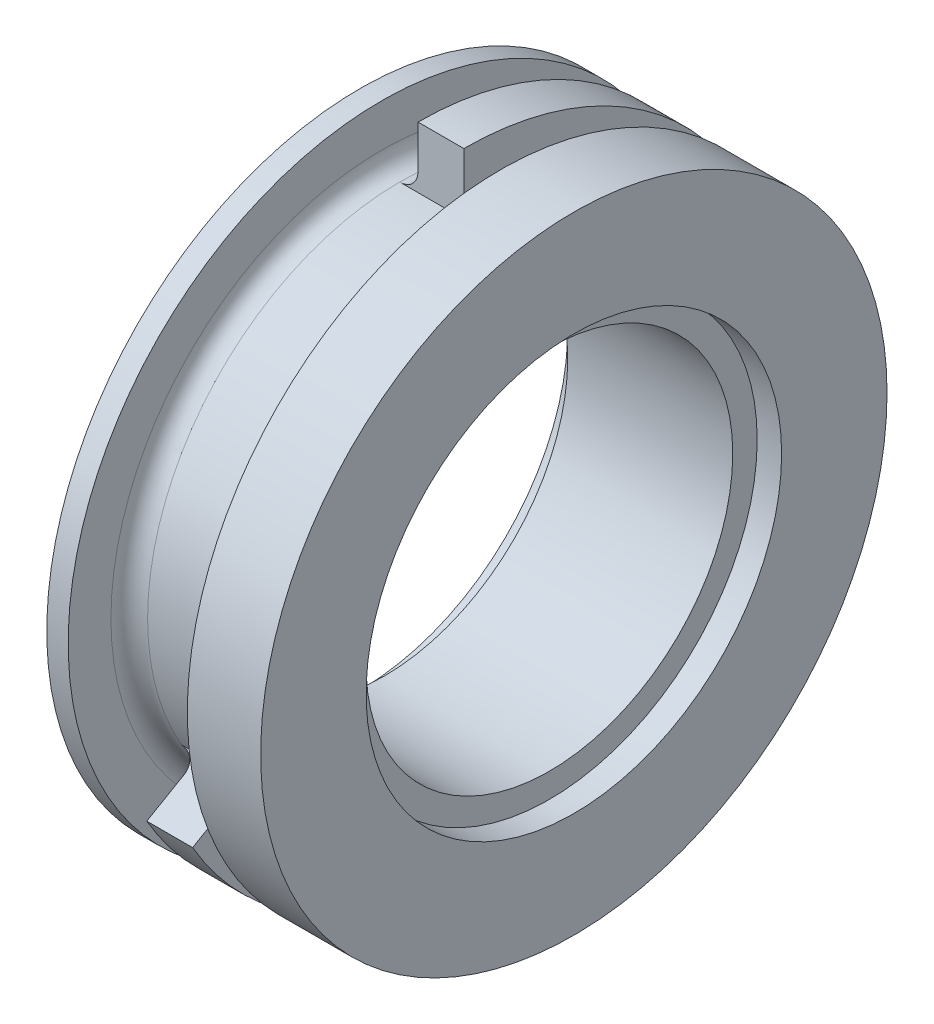
ISO-10303-21;
HEADER;
FILE_DESCRIPTION(('STEP AP214'),'2;1');
FILE_NAME('part.step','',(''),(''),'','','');
FILE_SCHEMA(('AUTOMOTIVE_DESIGN { 1 0 10303 214 1 1 1 1 }'));
ENDSEC;
DATA;
#1=APPLICATION_CONTEXT('core data for automotive mechanical design processes');
#2=APPLICATION_PROTOCOL_DEFINITION('international standard','automotive_design',2000,#1);
#3=PRODUCT_CONTEXT('',#1,'mechanical');
#4=PRODUCT('Part','Part','',(#3));
#5=PRODUCT_RELATED_PRODUCT_CATEGORY('part','',(#4));
#6=PRODUCT_DEFINITION_FORMATION('','',#4);
#7=PRODUCT_DEFINITION_CONTEXT('part definition',#1,'design');
#8=PRODUCT_DEFINITION('design','',#6,#7);
#9=PRODUCT_DEFINITION_SHAPE('','',#8);
#10=(LENGTH_UNIT() NAMED_UNIT(*) SI_UNIT(.MILLI.,.METRE.));
#11=(NAMED_UNIT(*) PLANE_ANGLE_UNIT() SI_UNIT($,.RADIAN.));
#12=(NAMED_UNIT(*) SI_UNIT($,.STERADIAN.) SOLID_ANGLE_UNIT());
#13=UNCERTAINTY_MEASURE_WITH_UNIT(LENGTH_MEASURE(1.E-05),#10,'distance_accuracy_value','');
#14=(GEOMETRIC_REPRESENTATION_CONTEXT(3) GLOBAL_UNCERTAINTY_ASSIGNED_CONTEXT((#13)) GLOBAL_UNIT_ASSIGNED_CONTEXT((#10,
#11,#12)) REPRESENTATION_CONTEXT('',''));
#15=CARTESIAN_POINT('',(0.,0.,0.));
#16=DIRECTION('',(0.,0.,1.));
#17=DIRECTION('',(1.,0.,0.));
#18=AXIS2_PLACEMENT_3D('',#15,#16,#17);
#19=CARTESIAN_POINT('',(7.,0.,0.));
#20=DIRECTION('',(1.,0.,0.));
#21=DIRECTION('',(0.,0.,-1.));
#22=AXIS2_PLACEMENT_3D('',#19,#20,#21);
#23=CYLINDRICAL_SURFACE('',#22,6.);
#24=CARTESIAN_POINT('',(6.2,0.,0.));
#25=DIRECTION('',(1.,0.,0.));
#26=DIRECTION('',(0.,0.,-1.));
#27=AXIS2_PLACEMENT_3D('',#24,#25,#26);
#28=CIRCLE('',#27,6.);
#29=CARTESIAN_POINT('',(6.2,0.,-6.));
#30=VERTEX_POINT('',#29);
#31=EDGE_CURVE('E158',#30,#30,#28,.T.);
#32=ORIENTED_EDGE('',*,*,#31,.T.);
#33=EDGE_LOOP('',(#32));
#34=FACE_BOUND('',#33,.T.);
#35=CARTESIAN_POINT('',(0.8,0.,0.));
#36=DIRECTION('',(-1.,0.,0.));
#37=DIRECTION('',(0.,0.,1.));
#38=AXIS2_PLACEMENT_3D('',#35,#36,#37);
#39=CIRCLE('',#38,6.);
#40=CARTESIAN_POINT('',(0.8,0.,6.));
#41=VERTEX_POINT('',#40);
#42=EDGE_CURVE('E47',#41,#41,#39,.T.);
#43=ORIENTED_EDGE('',*,*,#42,.T.);
#44=EDGE_LOOP('',(#43));
#45=FACE_BOUND('',#44,.T.);
#46=ADVANCED_FACE('F43',(#34,#45),#23,.F.);
#47=CARTESIAN_POINT('',(7.,0.,0.));
#48=DIRECTION('',(-1.,0.,0.));
#49=DIRECTION('',(0.,0.,1.));
#50=AXIS2_PLACEMENT_3D('',#47,#48,#49);
#51=PLANE('',#50);
#52=CARTESIAN_POINT('',(7.,0.,0.));
#53=DIRECTION('',(1.,0.,0.));
#54=DIRECTION('',(0.,0.,-1.));
#55=AXIS2_PLACEMENT_3D('',#52,#53,#54);
#56=CIRCLE('',#55,6.8);
#57=CARTESIAN_POINT('',(7.,0.,-6.8));
#58=VERTEX_POINT('',#57);
#59=EDGE_CURVE('E164',#58,#58,#56,.T.);
#60=ORIENTED_EDGE('',*,*,#59,.F.);
#61=EDGE_LOOP('',(#60));
#62=FACE_BOUND('',#61,.T.);
#63=CARTESIAN_POINT('',(7.,0.,0.));
#64=DIRECTION('',(1.,0.,0.));
#65=DIRECTION('',(0.,0.,-1.));
#66=AXIS2_PLACEMENT_3D('',#63,#64,#65);
#67=CIRCLE('',#66,10.25);
#68=CARTESIAN_POINT('',(7.,0.,-10.25));
#69=VERTEX_POINT('',#68);
#70=EDGE_CURVE('E126',#69,#69,#67,.T.);
#71=ORIENTED_EDGE('',*,*,#70,.T.);
#72=EDGE_LOOP('',(#71));
#73=FACE_BOUND('',#72,.T.);
#74=ADVANCED_FACE('F210',(#62,#73),#51,.F.);
#75=CARTESIAN_POINT('',(7.,0.,0.));
#76=DIRECTION('',(1.,0.,0.));
#77=DIRECTION('',(0.,0.,-1.));
#78=AXIS2_PLACEMENT_3D('',#75,#76,#77);
#79=CYLINDRICAL_SURFACE('',#78,10.25);
#80=ORIENTED_EDGE('',*,*,#70,.F.);
#81=EDGE_LOOP('',(#80));
#82=FACE_BOUND('',#81,.T.);
#83=CARTESIAN_POINT('',(4.6,0.,0.));
#84=DIRECTION('',(1.,0.,0.));
#85=DIRECTION('',(0.,0.,-1.));
#86=AXIS2_PLACEMENT_3D('',#83,#84,#85);
#87=CIRCLE('',#86,10.25);
#88=CARTESIAN_POINT('',(4.6,0.,-10.25));
#89=VERTEX_POINT('',#88);
#90=EDGE_CURVE('E123',#89,#89,#87,.T.);
#91=ORIENTED_EDGE('',*,*,#90,.T.);
#92=EDGE_LOOP('',(#91));
#93=FACE_BOUND('',#92,.T.);
#94=ADVANCED_FACE('F215',(#82,#93),#79,.T.);
#95=CARTESIAN_POINT('',(4.6,0.,0.));
#96=DIRECTION('',(1.,0.,0.));
#97=DIRECTION('',(0.,0.,-1.));
#98=AXIS2_PLACEMENT_3D('',#95,#96,#97);
#99=PLANE('',#98);
#100=CARTESIAN_POINT('',(4.6,0.,0.));
#101=DIRECTION('',(1.,0.,0.));
#102=DIRECTION('',(0.,0.,-1.));
#103=AXIS2_PLACEMENT_3D('',#100,#101,#102);
#104=CIRCLE('',#103,8.85);
#105=CARTESIAN_POINT('',(4.6,0.,-8.85));
#106=VERTEX_POINT('',#105);
#107=EDGE_CURVE('E134',#106,#106,#104,.T.);
#108=ORIENTED_EDGE('',*,*,#107,.T.);
#109=EDGE_LOOP('',(#108));
#110=FACE_BOUND('',#109,.T.);
#111=ORIENTED_EDGE('',*,*,#90,.F.);
#112=EDGE_LOOP('',(#111));
#113=FACE_BOUND('',#112,.T.);
#114=ADVANCED_FACE('F369',(#110,#113),#99,.F.);
#115=CARTESIAN_POINT('',(3.4,0.,0.));
#116=DIRECTION('',(-1.,0.,0.));
#117=DIRECTION('',(0.,0.,1.));
#118=AXIS2_PLACEMENT_3D('',#115,#116,#117);
#119=PLANE('',#118);
#120=DIRECTION('',(0.,1.,0.));
#121=VECTOR('',#120,1.);
#122=CARTESIAN_POINT('',(3.4,10.25,0.));
#123=LINE('',#122,#121);
#124=CARTESIAN_POINT('',(3.4,8.85,0.));
#125=VERTEX_POINT('',#124);
#126=CARTESIAN_POINT('',(3.4,10.25,0.));
#127=VERTEX_POINT('',#126);
#128=EDGE_CURVE('E96',#125,#127,#123,.T.);
#129=ORIENTED_EDGE('',*,*,#128,.F.);
#130=CARTESIAN_POINT('',(3.4,0.,0.));
#131=DIRECTION('',(-1.,0.,0.));
#132=DIRECTION('',(0.,0.,1.));
#133=AXIS2_PLACEMENT_3D('',#130,#131,#132);
#134=CIRCLE('',#133,8.85);
#135=CARTESIAN_POINT('',(3.4,-4.42500000000004,7.66432482349226));
#136=VERTEX_POINT('',#135);
#137=EDGE_CURVE('E143',#125,#136,#134,.T.);
#138=ORIENTED_EDGE('',*,*,#137,.T.);
#139=DIRECTION('',(0.,-0.500000000000004,0.866025403784436));
#140=VECTOR('',#139,1.);
#141=CARTESIAN_POINT('',(3.4,-5.12500000000004,8.87676038879047));
#142=LINE('',#141,#140);
#143=CARTESIAN_POINT('',(3.4,-5.12500000000004,8.87676038879047));
#144=VERTEX_POINT('',#143);
#145=EDGE_CURVE('E121',#136,#144,#142,.T.);
#146=ORIENTED_EDGE('',*,*,#145,.T.);
#147=CARTESIAN_POINT('',(3.4,0.,0.));
#148=DIRECTION('',(1.,0.,0.));
#149=DIRECTION('',(0.,0.,-1.));
#150=AXIS2_PLACEMENT_3D('',#147,#148,#149);
#151=CIRCLE('',#150,10.25);
#152=EDGE_CURVE('E114',#144,#127,#151,.T.);
#153=ORIENTED_EDGE('',*,*,#152,.T.);
#154=EDGE_LOOP('',(#129,#138,#146,#153));
#155=FACE_BOUND('',#154,.T.);
#156=ADVANCED_FACE('F119',(#155),#119,.F.);
#157=CARTESIAN_POINT('',(7.,0.,0.));
#158=DIRECTION('',(1.,0.,0.));
#159=DIRECTION('',(0.,0.,-1.));
#160=AXIS2_PLACEMENT_3D('',#157,#158,#159);
#161=CYLINDRICAL_SURFACE('',#160,10.25);
#162=ORIENTED_EDGE('',*,*,#152,.F.);
#163=DIRECTION('',(-1.,0.,0.));
#164=VECTOR('',#163,1.);
#165=CARTESIAN_POINT('',(1.9,-5.12500000000004,8.87676038879047));
#166=LINE('',#165,#164);
#167=CARTESIAN_POINT('',(1.9,-5.12500000000004,8.87676038879047));
#168=VERTEX_POINT('',#167);
#169=EDGE_CURVE('E178',#144,#168,#166,.T.);
#170=ORIENTED_EDGE('',*,*,#169,.T.);
#171=CARTESIAN_POINT('',(1.9,0.,0.));
#172=DIRECTION('',(1.,0.,0.));
#173=DIRECTION('',(0.,0.,-1.));
#174=AXIS2_PLACEMENT_3D('',#171,#172,#173);
#175=CIRCLE('',#174,10.25);
#176=CARTESIAN_POINT('',(1.9,10.25,0.));
#177=VERTEX_POINT('',#176);
#178=EDGE_CURVE('E116',#168,#177,#175,.T.);
#179=ORIENTED_EDGE('',*,*,#178,.T.);
#180=DIRECTION('',(-1.,0.,0.));
#181=VECTOR('',#180,1.);
#182=CARTESIAN_POINT('',(1.9,10.25,0.));
#183=LINE('',#182,#181);
#184=EDGE_CURVE('E100',#127,#177,#183,.T.);
#185=ORIENTED_EDGE('',*,*,#184,.F.);
#186=EDGE_LOOP('',(#162,#170,#179,#185));
#187=FACE_BOUND('',#186,.T.);
#188=ADVANCED_FACE('F112',(#187),#161,.T.);
#189=CARTESIAN_POINT('',(1.9,0.,0.));
#190=DIRECTION('',(1.,0.,0.));
#191=DIRECTION('',(0.,0.,-1.));
#192=AXIS2_PLACEMENT_3D('',#189,#190,#191);
#193=PLANE('',#192);
#194=DIRECTION('',(0.,0.500000000000004,-0.866025403784436));
#195=VECTOR('',#194,1.);
#196=CARTESIAN_POINT('',(1.9,-5.12500000000004,8.87676038879047));
#197=LINE('',#196,#195);
#198=CARTESIAN_POINT('',(1.9,-4.42500000000003,7.66432482349226));
#199=VERTEX_POINT('',#198);
#200=EDGE_CURVE('E180',#168,#199,#197,.T.);
#201=ORIENTED_EDGE('',*,*,#200,.T.);
#202=CARTESIAN_POINT('',(1.9,0.,0.));
#203=DIRECTION('',(1.,0.,0.));
#204=DIRECTION('',(0.,0.,-1.));
#205=AXIS2_PLACEMENT_3D('',#202,#203,#204);
#206=CIRCLE('',#205,8.85);
#207=CARTESIAN_POINT('',(1.9,8.85,0.));
#208=VERTEX_POINT('',#207);
#209=EDGE_CURVE('E145',#199,#208,#206,.T.);
#210=ORIENTED_EDGE('',*,*,#209,.T.);
#211=DIRECTION('',(0.,-1.,0.));
#212=VECTOR('',#211,1.);
#213=CARTESIAN_POINT('',(1.9,10.25,0.));
#214=LINE('',#213,#212);
#215=EDGE_CURVE('E117',#177,#208,#214,.T.);
#216=ORIENTED_EDGE('',*,*,#215,.F.);
#217=ORIENTED_EDGE('',*,*,#178,.F.);
#218=EDGE_LOOP('',(#201,#210,#216,#217));
#219=FACE_BOUND('',#218,.T.);
#220=ADVANCED_FACE('F326',(#219),#193,.F.);
#221=CARTESIAN_POINT('',(7.,0.,0.));
#222=DIRECTION('',(1.,0.,0.));
#223=DIRECTION('',(0.,0.,-1.));
#224=AXIS2_PLACEMENT_3D('',#221,#222,#223);
#225=CYLINDRICAL_SURFACE('',#224,8.25);
#226=CARTESIAN_POINT('',(4.,0.,0.));
#227=DIRECTION('',(1.,0.,0.));
#228=DIRECTION('',(0.,0.,-1.));
#229=AXIS2_PLACEMENT_3D('',#226,#227,#228);
#230=CIRCLE('',#229,8.25);
#231=CARTESIAN_POINT('',(4.,-4.12500000000003,7.1447095812216));
#232=VERTEX_POINT('',#231);
#233=CARTESIAN_POINT('',(4.,8.25,0.));
#234=VERTEX_POINT('',#233);
#235=EDGE_CURVE('E140',#232,#234,#230,.F.);
#236=ORIENTED_EDGE('',*,*,#235,.T.);
#237=DIRECTION('',(1.,0.,0.));
#238=VECTOR('',#237,1.);
#239=CARTESIAN_POINT('',(1.9,8.25,0.));
#240=LINE('',#239,#238);
#241=CARTESIAN_POINT('',(1.3,8.25,0.));
#242=VERTEX_POINT('',#241);
#243=EDGE_CURVE('E175',#242,#234,#240,.T.);
#244=ORIENTED_EDGE('',*,*,#243,.F.);
#245=CARTESIAN_POINT('',(1.3,0.,0.));
#246=DIRECTION('',(-1.,0.,0.));
#247=DIRECTION('',(0.,0.,1.));
#248=AXIS2_PLACEMENT_3D('',#245,#246,#247);
#249=CIRCLE('',#248,8.25);
#250=CARTESIAN_POINT('',(1.3,-4.12500000000003,7.1447095812216));
#251=VERTEX_POINT('',#250);
#252=EDGE_CURVE('E137',#242,#251,#249,.F.);
#253=ORIENTED_EDGE('',*,*,#252,.T.);
#254=DIRECTION('',(1.,0.,0.));
#255=VECTOR('',#254,1.);
#256=CARTESIAN_POINT('',(1.9,-4.12500000000003,7.1447095812216));
#257=LINE('',#256,#255);
#258=EDGE_CURVE('E182',#251,#232,#257,.T.);
#259=ORIENTED_EDGE('',*,*,#258,.T.);
#260=EDGE_LOOP('',(#236,#244,#253,#259));
#261=FACE_BOUND('',#260,.T.);
#262=ADVANCED_FACE('F321',(#261),#225,.T.);
#263=CARTESIAN_POINT('',(0.7,0.,0.));
#264=DIRECTION('',(-1.,0.,0.));
#265=DIRECTION('',(0.,0.,1.));
#266=AXIS2_PLACEMENT_3D('',#263,#264,#265);
#267=PLANE('',#266);
#268=CARTESIAN_POINT('',(0.7,0.,0.));
#269=DIRECTION('',(-1.,0.,0.));
#270=DIRECTION('',(0.,0.,1.));
#271=AXIS2_PLACEMENT_3D('',#268,#269,#270);
#272=CIRCLE('',#271,8.85);
#273=CARTESIAN_POINT('',(0.7,0.,8.85));
#274=VERTEX_POINT('',#273);
#275=EDGE_CURVE('E147',#274,#274,#272,.T.);
#276=ORIENTED_EDGE('',*,*,#275,.T.);
#277=EDGE_LOOP('',(#276));
#278=FACE_BOUND('',#277,.T.);
#279=CARTESIAN_POINT('',(0.7,0.,0.));
#280=DIRECTION('',(1.,0.,0.));
#281=DIRECTION('',(0.,0.,-1.));
#282=AXIS2_PLACEMENT_3D('',#279,#280,#281);
#283=CIRCLE('',#282,10.25);
#284=CARTESIAN_POINT('',(0.7,0.,-10.25));
#285=VERTEX_POINT('',#284);
#286=EDGE_CURVE('E128',#285,#285,#283,.T.);
#287=ORIENTED_EDGE('',*,*,#286,.T.);
#288=EDGE_LOOP('',(#287));
#289=FACE_BOUND('',#288,.T.);
#290=ADVANCED_FACE('F189',(#278,#289),#267,.F.);
#291=CARTESIAN_POINT('',(7.,0.,0.));
#292=DIRECTION('',(1.,0.,0.));
#293=DIRECTION('',(0.,0.,-1.));
#294=AXIS2_PLACEMENT_3D('',#291,#292,#293);
#295=CYLINDRICAL_SURFACE('',#294,10.25);
#296=ORIENTED_EDGE('',*,*,#286,.F.);
#297=EDGE_LOOP('',(#296));
#298=FACE_BOUND('',#297,.T.);
#299=CARTESIAN_POINT('',(0.,0.,0.));
#300=DIRECTION('',(1.,0.,0.));
#301=DIRECTION('',(0.,0.,-1.));
#302=AXIS2_PLACEMENT_3D('',#299,#300,#301);
#303=CIRCLE('',#302,10.25);
#304=CARTESIAN_POINT('',(0.,0.,-10.25));
#305=VERTEX_POINT('',#304);
#306=EDGE_CURVE('E184',#305,#305,#303,.T.);
#307=ORIENTED_EDGE('',*,*,#306,.T.);
#308=EDGE_LOOP('',(#307));
#309=FACE_BOUND('',#308,.T.);
#310=ADVANCED_FACE('F191',(#298,#309),#295,.T.);
#311=CARTESIAN_POINT('',(0.,0.,0.));
#312=DIRECTION('',(1.,0.,0.));
#313=DIRECTION('',(0.,0.,-1.));
#314=AXIS2_PLACEMENT_3D('',#311,#312,#313);
#315=PLANE('',#314);
#316=CARTESIAN_POINT('',(0.,0.,0.));
#317=DIRECTION('',(-1.,0.,0.));
#318=DIRECTION('',(0.,0.,1.));
#319=AXIS2_PLACEMENT_3D('',#316,#317,#318);
#320=CIRCLE('',#319,6.8);
#321=CARTESIAN_POINT('',(0.,0.,6.8));
#322=VERTEX_POINT('',#321);
#323=EDGE_CURVE('E171',#322,#322,#320,.T.);
#324=ORIENTED_EDGE('',*,*,#323,.F.);
#325=EDGE_LOOP('',(#324));
#326=FACE_BOUND('',#325,.T.);
#327=ORIENTED_EDGE('',*,*,#306,.F.);
#328=EDGE_LOOP('',(#327));
#329=FACE_BOUND('',#328,.T.);
#330=ADVANCED_FACE('F194',(#326,#329),#315,.F.);
#331=CARTESIAN_POINT('',(0.,0.,0.));
#332=DIRECTION('',(0.,-0.866025403784436,-0.500000000000004));
#333=DIRECTION('',(1.,0.,0.));
#334=AXIS2_PLACEMENT_3D('',#331,#332,#333);
#335=PLANE('',#334);
#336=ORIENTED_EDGE('',*,*,#145,.F.);
#337=CARTESIAN_POINT('',(4.,-4.42500000000004,7.66432482349226));
#338=DIRECTION('',(0.,-0.866025403784436,-0.500000000000004));
#339=DIRECTION('',(0.,0.500000000000004,-0.866025403784436));
#340=AXIS2_PLACEMENT_3D('',#337,#338,#339);
#341=CIRCLE('',#340,0.6);
#342=EDGE_CURVE('E151',#136,#232,#341,.T.);
#343=ORIENTED_EDGE('',*,*,#342,.T.);
#344=ORIENTED_EDGE('',*,*,#258,.F.);
#345=CARTESIAN_POINT('',(1.3,-4.42500000000004,7.66432482349226));
#346=DIRECTION('',(0.,-0.866025403784436,-0.500000000000004));
#347=DIRECTION('',(0.,0.500000000000004,-0.866025403784436));
#348=AXIS2_PLACEMENT_3D('',#345,#346,#347);
#349=CIRCLE('',#348,0.6);
#350=EDGE_CURVE('E11',#251,#199,#349,.T.);
#351=ORIENTED_EDGE('',*,*,#350,.T.);
#352=ORIENTED_EDGE('',*,*,#200,.F.);
#353=ORIENTED_EDGE('',*,*,#169,.F.);
#354=EDGE_LOOP('',(#336,#343,#344,#351,#352,#353));
#355=FACE_BOUND('',#354,.T.);
#356=ADVANCED_FACE('F199',(#355),#335,.F.);
#357=CARTESIAN_POINT('',(0.,0.,0.));
#358=DIRECTION('',(0.,0.,1.));
#359=DIRECTION('',(1.,0.,0.));
#360=AXIS2_PLACEMENT_3D('',#357,#358,#359);
#361=PLANE('',#360);
#362=ORIENTED_EDGE('',*,*,#243,.T.);
#363=CARTESIAN_POINT('',(4.,8.85,0.));
#364=DIRECTION('',(0.,0.,1.));
#365=DIRECTION('',(1.,0.,0.));
#366=AXIS2_PLACEMENT_3D('',#363,#364,#365);
#367=CIRCLE('',#366,0.6);
#368=EDGE_CURVE('E103',#234,#125,#367,.F.);
#369=ORIENTED_EDGE('',*,*,#368,.T.);
#370=ORIENTED_EDGE('',*,*,#128,.T.);
#371=ORIENTED_EDGE('',*,*,#184,.T.);
#372=ORIENTED_EDGE('',*,*,#215,.T.);
#373=CARTESIAN_POINT('',(1.3,8.85,0.));
#374=DIRECTION('',(0.,0.,1.));
#375=DIRECTION('',(1.,0.,0.));
#376=AXIS2_PLACEMENT_3D('',#373,#374,#375);
#377=CIRCLE('',#376,0.6);
#378=EDGE_CURVE('E52',#208,#242,#377,.F.);
#379=ORIENTED_EDGE('',*,*,#378,.T.);
#380=EDGE_LOOP('',(#362,#369,#370,#371,#372,#379));
#381=FACE_BOUND('',#380,.T.);
#382=ADVANCED_FACE('F98',(#381),#361,.T.);
#383=CARTESIAN_POINT('',(4.,0.,0.));
#384=DIRECTION('',(-1.,0.,0.));
#385=DIRECTION('',(0.,0.,1.));
#386=AXIS2_PLACEMENT_3D('',#383,#384,#385);
#387=TOROIDAL_SURFACE('',#386,8.85,0.6);
#388=CARTESIAN_POINT('',(4.,0.,0.));
#389=DIRECTION('',(-1.,0.,0.));
#390=DIRECTION('',(0.,0.,1.));
#391=AXIS2_PLACEMENT_3D('',#388,#389,#390);
#392=CIRCLE('',#391,8.25);
#393=EDGE_CURVE('E107',#232,#234,#392,.F.);
#394=ORIENTED_EDGE('',*,*,#393,.F.);
#395=ORIENTED_EDGE('',*,*,#342,.F.);
#396=ORIENTED_EDGE('',*,*,#137,.F.);
#397=ORIENTED_EDGE('',*,*,#368,.F.);
#398=EDGE_LOOP('',(#394,#395,#396,#397));
#399=FACE_BOUND('',#398,.T.);
#400=ADVANCED_FACE('F222',(#399),#387,.F.);
#401=CARTESIAN_POINT('',(4.,0.,0.));
#402=DIRECTION('',(1.,0.,0.));
#403=DIRECTION('',(0.,0.,-1.));
#404=AXIS2_PLACEMENT_3D('',#401,#402,#403);
#405=TOROIDAL_SURFACE('',#404,8.85,0.6);
#406=ORIENTED_EDGE('',*,*,#235,.F.);
#407=ORIENTED_EDGE('',*,*,#393,.T.);
#408=EDGE_LOOP('',(#406,#407));
#409=FACE_BOUND('',#408,.T.);
#410=ORIENTED_EDGE('',*,*,#107,.F.);
#411=EDGE_LOOP('',(#410));
#412=FACE_BOUND('',#411,.T.);
#413=ADVANCED_FACE('F285',(#409,#412),#405,.F.);
#414=CARTESIAN_POINT('',(1.3,0.,0.));
#415=DIRECTION('',(-1.,0.,0.));
#416=DIRECTION('',(0.,0.,1.));
#417=AXIS2_PLACEMENT_3D('',#414,#415,#416);
#418=TOROIDAL_SURFACE('',#417,8.85,0.6);
#419=ORIENTED_EDGE('',*,*,#275,.F.);
#420=EDGE_LOOP('',(#419));
#421=FACE_BOUND('',#420,.T.);
#422=CARTESIAN_POINT('',(1.3,0.,0.));
#423=DIRECTION('',(-1.,0.,0.));
#424=DIRECTION('',(0.,0.,1.));
#425=AXIS2_PLACEMENT_3D('',#422,#423,#424);
#426=CIRCLE('',#425,8.25);
#427=EDGE_CURVE('E157',#251,#242,#426,.F.);
#428=ORIENTED_EDGE('',*,*,#427,.F.);
#429=ORIENTED_EDGE('',*,*,#252,.F.);
#430=EDGE_LOOP('',(#428,#429));
#431=FACE_BOUND('',#430,.T.);
#432=ADVANCED_FACE('F45',(#421,#431),#418,.F.);
#433=CARTESIAN_POINT('',(1.3,0.,0.));
#434=DIRECTION('',(1.,0.,0.));
#435=DIRECTION('',(0.,0.,-1.));
#436=AXIS2_PLACEMENT_3D('',#433,#434,#435);
#437=TOROIDAL_SURFACE('',#436,8.85,0.6);
#438=ORIENTED_EDGE('',*,*,#350,.F.);
#439=ORIENTED_EDGE('',*,*,#427,.T.);
#440=ORIENTED_EDGE('',*,*,#378,.F.);
#441=ORIENTED_EDGE('',*,*,#209,.F.);
#442=EDGE_LOOP('',(#438,#439,#440,#441));
#443=FACE_BOUND('',#442,.T.);
#444=ADVANCED_FACE('F227',(#443),#437,.F.);
#445=CARTESIAN_POINT('',(6.2,0.,0.));
#446=DIRECTION('',(1.,0.,0.));
#447=DIRECTION('',(0.,0.,-1.));
#448=AXIS2_PLACEMENT_3D('',#445,#446,#447);
#449=CYLINDRICAL_SURFACE('',#448,6.8);
#450=CARTESIAN_POINT('',(6.2,0.,0.));
#451=DIRECTION('',(1.,0.,0.));
#452=DIRECTION('',(0.,0.,-1.));
#453=AXIS2_PLACEMENT_3D('',#450,#451,#452);
#454=CIRCLE('',#453,6.8);
#455=CARTESIAN_POINT('',(6.2,0.,-6.8));
#456=VERTEX_POINT('',#455);
#457=EDGE_CURVE('E160',#456,#456,#454,.T.);
#458=ORIENTED_EDGE('',*,*,#457,.F.);
#459=EDGE_LOOP('',(#458));
#460=FACE_BOUND('',#459,.T.);
#461=ORIENTED_EDGE('',*,*,#59,.T.);
#462=EDGE_LOOP('',(#461));
#463=FACE_BOUND('',#462,.T.);
#464=ADVANCED_FACE('F223',(#460,#463),#449,.F.);
#465=CARTESIAN_POINT('',(6.2,0.,0.));
#466=DIRECTION('',(1.,0.,0.));
#467=DIRECTION('',(0.,0.,-1.));
#468=AXIS2_PLACEMENT_3D('',#465,#466,#467);
#469=PLANE('',#468);
#470=ORIENTED_EDGE('',*,*,#31,.F.);
#471=EDGE_LOOP('',(#470));
#472=FACE_BOUND('',#471,.T.);
#473=ORIENTED_EDGE('',*,*,#457,.T.);
#474=EDGE_LOOP('',(#473));
#475=FACE_BOUND('',#474,.T.);
#476=ADVANCED_FACE('F226',(#472,#475),#469,.T.);
#477=CARTESIAN_POINT('',(0.8,0.,0.));
#478=DIRECTION('',(-1.,0.,0.));
#479=DIRECTION('',(0.,0.,1.));
#480=AXIS2_PLACEMENT_3D('',#477,#478,#479);
#481=CYLINDRICAL_SURFACE('',#480,6.8);
#482=CARTESIAN_POINT('',(0.8,0.,0.));
#483=DIRECTION('',(-1.,0.,0.));
#484=DIRECTION('',(0.,0.,1.));
#485=AXIS2_PLACEMENT_3D('',#482,#483,#484);
#486=CIRCLE('',#485,6.8);
#487=CARTESIAN_POINT('',(0.8,0.,6.8));
#488=VERTEX_POINT('',#487);
#489=EDGE_CURVE('E244',#488,#488,#486,.T.);
#490=ORIENTED_EDGE('',*,*,#489,.F.);
#491=EDGE_LOOP('',(#490));
#492=FACE_BOUND('',#491,.T.);
#493=ORIENTED_EDGE('',*,*,#323,.T.);
#494=EDGE_LOOP('',(#493));
#495=FACE_BOUND('',#494,.T.);
#496=ADVANCED_FACE('F230',(#492,#495),#481,.F.);
#497=CARTESIAN_POINT('',(0.8,0.,0.));
#498=DIRECTION('',(-1.,0.,0.));
#499=DIRECTION('',(0.,0.,1.));
#500=AXIS2_PLACEMENT_3D('',#497,#498,#499);
#501=PLANE('',#500);
#502=ORIENTED_EDGE('',*,*,#42,.F.);
#503=EDGE_LOOP('',(#502));
#504=FACE_BOUND('',#503,.T.);
#505=ORIENTED_EDGE('',*,*,#489,.T.);
#506=EDGE_LOOP('',(#505));
#507=FACE_BOUND('',#506,.T.);
#508=ADVANCED_FACE('F233',(#504,#507),#501,.T.);
#509=CLOSED_SHELL('',(#46,#74,#94,#114,#156,#188,#220,#262,#290,#310,#330,#356,#382,#400,#413,
#432,#444,#464,#476,#496,#508));
#510=MANIFOLD_SOLID_BREP('B2',#509);
#511=ADVANCED_BREP_SHAPE_REPRESENTATION('',(#18,#510),#14);
#512=SHAPE_DEFINITION_REPRESENTATION(#9,#511);
ENDSEC;
END-ISO-10303-21;
